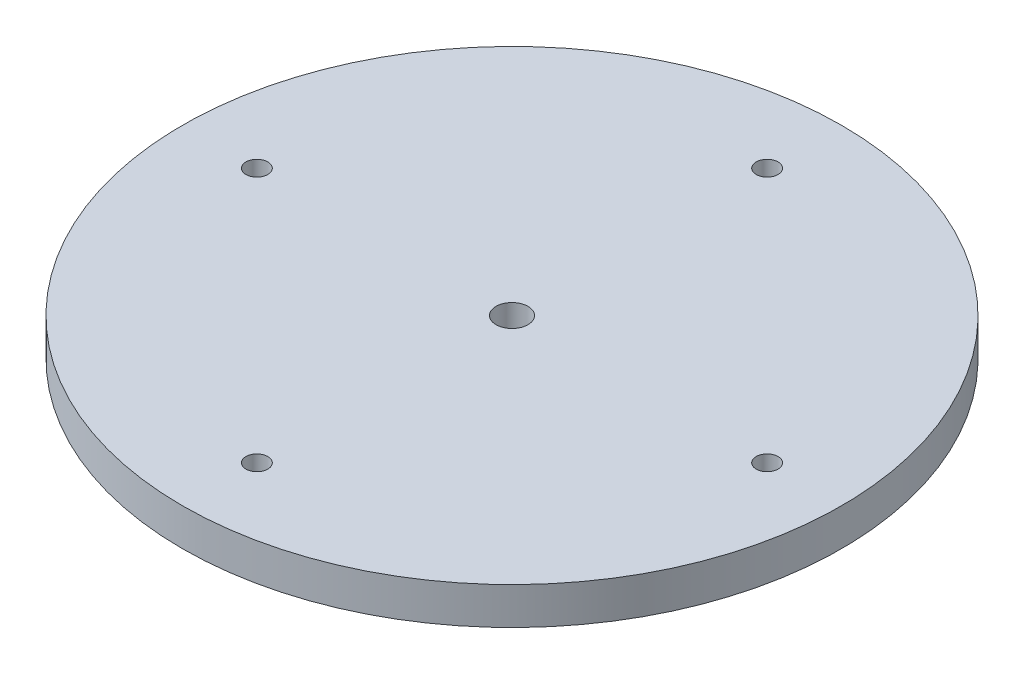
ISO-10303-21;
HEADER;
FILE_DESCRIPTION(('STEP AP214'),'2;1');
FILE_NAME('part.step','',(''),(''),'','','');
FILE_SCHEMA(('AUTOMOTIVE_DESIGN { 1 0 10303 214 1 1 1 1 }'));
ENDSEC;
DATA;
#1=APPLICATION_CONTEXT('core data for automotive mechanical design processes');
#2=APPLICATION_PROTOCOL_DEFINITION('international standard','automotive_design',2000,#1);
#3=PRODUCT_CONTEXT('',#1,'mechanical');
#4=PRODUCT('Part','Part','',(#3));
#5=PRODUCT_RELATED_PRODUCT_CATEGORY('part','',(#4));
#6=PRODUCT_DEFINITION_FORMATION('','',#4);
#7=PRODUCT_DEFINITION_CONTEXT('part definition',#1,'design');
#8=PRODUCT_DEFINITION('design','',#6,#7);
#9=PRODUCT_DEFINITION_SHAPE('','',#8);
#10=(LENGTH_UNIT() NAMED_UNIT(*) SI_UNIT(.MILLI.,.METRE.));
#11=(NAMED_UNIT(*) PLANE_ANGLE_UNIT() SI_UNIT($,.RADIAN.));
#12=(NAMED_UNIT(*) SI_UNIT($,.STERADIAN.) SOLID_ANGLE_UNIT());
#13=UNCERTAINTY_MEASURE_WITH_UNIT(LENGTH_MEASURE(1.E-05),#10,'distance_accuracy_value','');
#14=(GEOMETRIC_REPRESENTATION_CONTEXT(3) GLOBAL_UNCERTAINTY_ASSIGNED_CONTEXT((#13)) GLOBAL_UNIT_ASSIGNED_CONTEXT((#10,
#11,#12)) REPRESENTATION_CONTEXT('',''));
#15=CARTESIAN_POINT('',(0.,0.,0.));
#16=DIRECTION('',(0.,0.,1.));
#17=DIRECTION('',(1.,0.,0.));
#18=AXIS2_PLACEMENT_3D('',#15,#16,#17);
#19=CARTESIAN_POINT('',(0.,-5.55625,0.));
#20=DIRECTION('',(0.,1.,0.));
#21=DIRECTION('',(0.,0.,1.));
#22=AXIS2_PLACEMENT_3D('',#19,#20,#21);
#23=CYLINDRICAL_SURFACE('',#22,98.425);
#24=CARTESIAN_POINT('',(0.,-5.55625,0.));
#25=DIRECTION('',(0.,1.,0.));
#26=DIRECTION('',(0.,0.,1.));
#27=AXIS2_PLACEMENT_3D('',#24,#25,#26);
#28=CIRCLE('',#27,98.425);
#29=CARTESIAN_POINT('',(0.,-5.55625,98.425));
#30=VERTEX_POINT('',#29);
#31=EDGE_CURVE('E10',#30,#30,#28,.T.);
#32=ORIENTED_EDGE('',*,*,#31,.T.);
#33=EDGE_LOOP('',(#32));
#34=FACE_BOUND('',#33,.T.);
#35=CARTESIAN_POINT('',(0.,5.55625,0.));
#36=DIRECTION('',(0.,1.,0.));
#37=DIRECTION('',(0.,0.,1.));
#38=AXIS2_PLACEMENT_3D('',#35,#36,#37);
#39=CIRCLE('',#38,98.425);
#40=CARTESIAN_POINT('',(0.,5.55625,98.425));
#41=VERTEX_POINT('',#40);
#42=EDGE_CURVE('E45',#41,#41,#39,.T.);
#43=ORIENTED_EDGE('',*,*,#42,.F.);
#44=EDGE_LOOP('',(#43));
#45=FACE_BOUND('',#44,.T.);
#46=ADVANCED_FACE('F35',(#34,#45),#23,.T.);
#47=CARTESIAN_POINT('',(0.,-5.55625,0.));
#48=DIRECTION('',(0.,1.,0.));
#49=DIRECTION('',(0.,0.,1.));
#50=AXIS2_PLACEMENT_3D('',#47,#48,#49);
#51=PLANE('',#50);
#52=CARTESIAN_POINT('',(-76.2,-5.55625,7.9815263405954E-13));
#53=DIRECTION('',(0.,1.,0.));
#54=DIRECTION('',(0.,0.,1.));
#55=AXIS2_PLACEMENT_3D('',#52,#53,#54);
#56=CIRCLE('',#55,3.2639);
#57=CARTESIAN_POINT('',(-76.2,-5.55625,3.2639000000008));
#58=VERTEX_POINT('',#57);
#59=EDGE_CURVE('E72',#58,#58,#56,.T.);
#60=ORIENTED_EDGE('',*,*,#59,.T.);
#61=EDGE_LOOP('',(#60));
#62=FACE_BOUND('',#61,.T.);
#63=CARTESIAN_POINT('',(0.,-5.55625,-76.2));
#64=DIRECTION('',(0.,1.,0.));
#65=DIRECTION('',(0.,0.,1.));
#66=AXIS2_PLACEMENT_3D('',#63,#64,#65);
#67=CIRCLE('',#66,3.2639);
#68=CARTESIAN_POINT('',(0.,-5.55625,-72.9361));
#69=VERTEX_POINT('',#68);
#70=EDGE_CURVE('E66',#69,#69,#67,.T.);
#71=ORIENTED_EDGE('',*,*,#70,.T.);
#72=EDGE_LOOP('',(#71));
#73=FACE_BOUND('',#72,.T.);
#74=CARTESIAN_POINT('',(76.2,-5.55625,-2.66050878019847E-13));
#75=DIRECTION('',(0.,1.,0.));
#76=DIRECTION('',(0.,0.,1.));
#77=AXIS2_PLACEMENT_3D('',#74,#75,#76);
#78=CIRCLE('',#77,3.2639);
#79=CARTESIAN_POINT('',(76.2,-5.55625,3.26389999999973));
#80=VERTEX_POINT('',#79);
#81=EDGE_CURVE('E60',#80,#80,#78,.T.);
#82=ORIENTED_EDGE('',*,*,#81,.T.);
#83=EDGE_LOOP('',(#82));
#84=FACE_BOUND('',#83,.T.);
#85=CARTESIAN_POINT('',(0.,-5.55625,76.2));
#86=DIRECTION('',(0.,1.,0.));
#87=DIRECTION('',(0.,0.,1.));
#88=AXIS2_PLACEMENT_3D('',#85,#86,#87);
#89=CIRCLE('',#88,3.2639);
#90=CARTESIAN_POINT('',(0.,-5.55625,79.4639));
#91=VERTEX_POINT('',#90);
#92=EDGE_CURVE('E54',#91,#91,#89,.T.);
#93=ORIENTED_EDGE('',*,*,#92,.T.);
#94=EDGE_LOOP('',(#93));
#95=FACE_BOUND('',#94,.T.);
#96=CARTESIAN_POINT('',(0.,-5.55625,0.));
#97=DIRECTION('',(0.,1.,0.));
#98=DIRECTION('',(0.,0.,1.));
#99=AXIS2_PLACEMENT_3D('',#96,#97,#98);
#100=CIRCLE('',#99,4.7625);
#101=CARTESIAN_POINT('',(0.,-5.55625,4.7625));
#102=VERTEX_POINT('',#101);
#103=EDGE_CURVE('E41',#102,#102,#100,.T.);
#104=ORIENTED_EDGE('',*,*,#103,.T.);
#105=EDGE_LOOP('',(#104));
#106=FACE_BOUND('',#105,.T.);
#107=ORIENTED_EDGE('',*,*,#31,.F.);
#108=EDGE_LOOP('',(#107));
#109=FACE_BOUND('',#108,.T.);
#110=ADVANCED_FACE('F99',(#62,#73,#84,#95,#106,#109),#51,.F.);
#111=CARTESIAN_POINT('',(0.,-5.55625,0.));
#112=DIRECTION('',(0.,1.,0.));
#113=DIRECTION('',(0.,0.,1.));
#114=AXIS2_PLACEMENT_3D('',#111,#112,#113);
#115=CYLINDRICAL_SURFACE('',#114,4.7625);
#116=ORIENTED_EDGE('',*,*,#103,.F.);
#117=EDGE_LOOP('',(#116));
#118=FACE_BOUND('',#117,.T.);
#119=CARTESIAN_POINT('',(0.,5.55625,0.));
#120=DIRECTION('',(0.,1.,0.));
#121=DIRECTION('',(0.,0.,1.));
#122=AXIS2_PLACEMENT_3D('',#119,#120,#121);
#123=CIRCLE('',#122,4.7625);
#124=CARTESIAN_POINT('',(0.,5.55625,4.7625));
#125=VERTEX_POINT('',#124);
#126=EDGE_CURVE('E49',#125,#125,#123,.T.);
#127=ORIENTED_EDGE('',*,*,#126,.T.);
#128=EDGE_LOOP('',(#127));
#129=FACE_BOUND('',#128,.T.);
#130=ADVANCED_FACE('F86',(#118,#129),#115,.F.);
#131=CARTESIAN_POINT('',(0.,5.55625,0.));
#132=DIRECTION('',(0.,1.,0.));
#133=DIRECTION('',(0.,0.,1.));
#134=AXIS2_PLACEMENT_3D('',#131,#132,#133);
#135=PLANE('',#134);
#136=CARTESIAN_POINT('',(-76.2,5.55625,7.9815263405954E-13));
#137=DIRECTION('',(0.,1.,0.));
#138=DIRECTION('',(0.,0.,1.));
#139=AXIS2_PLACEMENT_3D('',#136,#137,#138);
#140=CIRCLE('',#139,3.2639);
#141=CARTESIAN_POINT('',(-76.2,5.55625,3.2639000000008));
#142=VERTEX_POINT('',#141);
#143=EDGE_CURVE('E75',#142,#142,#140,.T.);
#144=ORIENTED_EDGE('',*,*,#143,.F.);
#145=EDGE_LOOP('',(#144));
#146=FACE_BOUND('',#145,.T.);
#147=CARTESIAN_POINT('',(0.,5.55625,-76.2));
#148=DIRECTION('',(0.,1.,0.));
#149=DIRECTION('',(0.,0.,1.));
#150=AXIS2_PLACEMENT_3D('',#147,#148,#149);
#151=CIRCLE('',#150,3.2639);
#152=CARTESIAN_POINT('',(0.,5.55625,-72.9361));
#153=VERTEX_POINT('',#152);
#154=EDGE_CURVE('E69',#153,#153,#151,.T.);
#155=ORIENTED_EDGE('',*,*,#154,.F.);
#156=EDGE_LOOP('',(#155));
#157=FACE_BOUND('',#156,.T.);
#158=CARTESIAN_POINT('',(76.2,5.55625,-2.66050878019847E-13));
#159=DIRECTION('',(0.,1.,0.));
#160=DIRECTION('',(0.,0.,1.));
#161=AXIS2_PLACEMENT_3D('',#158,#159,#160);
#162=CIRCLE('',#161,3.2639);
#163=CARTESIAN_POINT('',(76.2,5.55625,3.26389999999973));
#164=VERTEX_POINT('',#163);
#165=EDGE_CURVE('E63',#164,#164,#162,.T.);
#166=ORIENTED_EDGE('',*,*,#165,.F.);
#167=EDGE_LOOP('',(#166));
#168=FACE_BOUND('',#167,.T.);
#169=CARTESIAN_POINT('',(0.,5.55625,76.2));
#170=DIRECTION('',(0.,1.,0.));
#171=DIRECTION('',(0.,0.,1.));
#172=AXIS2_PLACEMENT_3D('',#169,#170,#171);
#173=CIRCLE('',#172,3.2639);
#174=CARTESIAN_POINT('',(0.,5.55625,79.4639));
#175=VERTEX_POINT('',#174);
#176=EDGE_CURVE('E57',#175,#175,#173,.T.);
#177=ORIENTED_EDGE('',*,*,#176,.F.);
#178=EDGE_LOOP('',(#177));
#179=FACE_BOUND('',#178,.T.);
#180=ORIENTED_EDGE('',*,*,#42,.T.);
#181=EDGE_LOOP('',(#180));
#182=FACE_BOUND('',#181,.T.);
#183=ORIENTED_EDGE('',*,*,#126,.F.);
#184=EDGE_LOOP('',(#183));
#185=FACE_BOUND('',#184,.T.);
#186=ADVANCED_FACE('F82',(#146,#157,#168,#179,#182,#185),#135,.T.);
#187=CARTESIAN_POINT('',(0.,5.55625,76.2));
#188=DIRECTION('',(0.,1.,0.));
#189=DIRECTION('',(0.,0.,1.));
#190=AXIS2_PLACEMENT_3D('',#187,#188,#189);
#191=CYLINDRICAL_SURFACE('',#190,3.2639);
#192=ORIENTED_EDGE('',*,*,#176,.T.);
#193=EDGE_LOOP('',(#192));
#194=FACE_BOUND('',#193,.T.);
#195=ORIENTED_EDGE('',*,*,#92,.F.);
#196=EDGE_LOOP('',(#195));
#197=FACE_BOUND('',#196,.T.);
#198=ADVANCED_FACE('F85',(#194,#197),#191,.F.);
#199=CARTESIAN_POINT('',(76.2,5.55625,-2.66050878019847E-13));
#200=DIRECTION('',(0.,1.,0.));
#201=DIRECTION('',(0.,0.,1.));
#202=AXIS2_PLACEMENT_3D('',#199,#200,#201);
#203=CYLINDRICAL_SURFACE('',#202,3.2639);
#204=ORIENTED_EDGE('',*,*,#165,.T.);
#205=EDGE_LOOP('',(#204));
#206=FACE_BOUND('',#205,.T.);
#207=ORIENTED_EDGE('',*,*,#81,.F.);
#208=EDGE_LOOP('',(#207));
#209=FACE_BOUND('',#208,.T.);
#210=ADVANCED_FACE('F132',(#206,#209),#203,.F.);
#211=CARTESIAN_POINT('',(0.,5.55625,-76.2));
#212=DIRECTION('',(0.,1.,0.));
#213=DIRECTION('',(0.,0.,1.));
#214=AXIS2_PLACEMENT_3D('',#211,#212,#213);
#215=CYLINDRICAL_SURFACE('',#214,3.2639);
#216=ORIENTED_EDGE('',*,*,#154,.T.);
#217=EDGE_LOOP('',(#216));
#218=FACE_BOUND('',#217,.T.);
#219=ORIENTED_EDGE('',*,*,#70,.F.);
#220=EDGE_LOOP('',(#219));
#221=FACE_BOUND('',#220,.T.);
#222=ADVANCED_FACE('F137',(#218,#221),#215,.F.);
#223=CARTESIAN_POINT('',(-76.2,5.55625,7.9815263405954E-13));
#224=DIRECTION('',(0.,1.,0.));
#225=DIRECTION('',(0.,0.,1.));
#226=AXIS2_PLACEMENT_3D('',#223,#224,#225);
#227=CYLINDRICAL_SURFACE('',#226,3.2639);
#228=ORIENTED_EDGE('',*,*,#143,.T.);
#229=EDGE_LOOP('',(#228));
#230=FACE_BOUND('',#229,.T.);
#231=ORIENTED_EDGE('',*,*,#59,.F.);
#232=EDGE_LOOP('',(#231));
#233=FACE_BOUND('',#232,.T.);
#234=ADVANCED_FACE('F79',(#230,#233),#227,.F.);
#235=CLOSED_SHELL('',(#46,#110,#130,#186,#198,#210,#222,#234));
#236=MANIFOLD_SOLID_BREP('B2',#235);
#237=ADVANCED_BREP_SHAPE_REPRESENTATION('',(#18,#236),#14);
#238=SHAPE_DEFINITION_REPRESENTATION(#9,#237);
ENDSEC;
END-ISO-10303-21;
